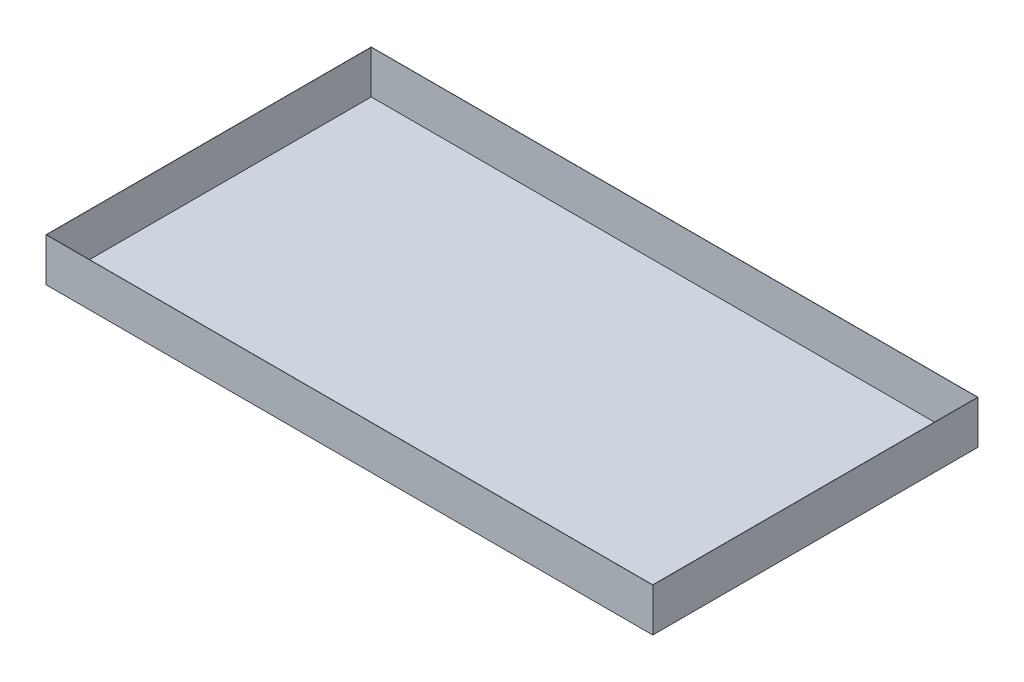
ISO-10303-21;
HEADER;
FILE_DESCRIPTION(('STEP AP214'),'2;1');
FILE_NAME('part.step','',(''),(''),'','','');
FILE_SCHEMA(('AUTOMOTIVE_DESIGN { 1 0 10303 214 1 1 1 1 }'));
ENDSEC;
DATA;
#1=APPLICATION_CONTEXT('core data for automotive mechanical design processes');
#2=APPLICATION_PROTOCOL_DEFINITION('international standard','automotive_design',2000,#1);
#3=PRODUCT_CONTEXT('',#1,'mechanical');
#4=PRODUCT('Part','Part','',(#3));
#5=PRODUCT_RELATED_PRODUCT_CATEGORY('part','',(#4));
#6=PRODUCT_DEFINITION_FORMATION('','',#4);
#7=PRODUCT_DEFINITION_CONTEXT('part definition',#1,'design');
#8=PRODUCT_DEFINITION('design','',#6,#7);
#9=PRODUCT_DEFINITION_SHAPE('','',#8);
#10=(LENGTH_UNIT() NAMED_UNIT(*) SI_UNIT(.MILLI.,.METRE.));
#11=(NAMED_UNIT(*) PLANE_ANGLE_UNIT() SI_UNIT($,.RADIAN.));
#12=(NAMED_UNIT(*) SI_UNIT($,.STERADIAN.) SOLID_ANGLE_UNIT());
#13=UNCERTAINTY_MEASURE_WITH_UNIT(LENGTH_MEASURE(1.E-05),#10,'distance_accuracy_value','');
#14=(GEOMETRIC_REPRESENTATION_CONTEXT(3) GLOBAL_UNCERTAINTY_ASSIGNED_CONTEXT((#13)) GLOBAL_UNIT_ASSIGNED_CONTEXT((#10,
#11,#12)) REPRESENTATION_CONTEXT('',''));
#15=CARTESIAN_POINT('',(0.,0.,0.));
#16=DIRECTION('',(0.,0.,1.));
#17=DIRECTION('',(1.,0.,0.));
#18=AXIS2_PLACEMENT_3D('',#15,#16,#17);
#19=CARTESIAN_POINT('',(0.,10.,0.));
#20=DIRECTION('',(0.,1.,0.));
#21=DIRECTION('',(0.,0.,1.));
#22=AXIS2_PLACEMENT_3D('',#19,#20,#21);
#23=PLANE('',#22);
#24=DIRECTION('',(0.,0.,1.));
#25=VECTOR('',#24,1.);
#26=CARTESIAN_POINT('',(-14000.,10.,7500.));
#27=LINE('',#26,#25);
#28=CARTESIAN_POINT('',(-14000.,10.,-7500.));
#29=VERTEX_POINT('',#28);
#30=CARTESIAN_POINT('',(-14000.,10.,7500.));
#31=VERTEX_POINT('',#30);
#32=EDGE_CURVE('E104',#29,#31,#27,.T.);
#33=ORIENTED_EDGE('',*,*,#32,.T.);
#34=DIRECTION('',(1.,0.,0.));
#35=VECTOR('',#34,1.);
#36=CARTESIAN_POINT('',(14000.,10.,7500.));
#37=LINE('',#36,#35);
#38=CARTESIAN_POINT('',(14000.,10.,7500.));
#39=VERTEX_POINT('',#38);
#40=EDGE_CURVE('E57',#31,#39,#37,.T.);
#41=ORIENTED_EDGE('',*,*,#40,.T.);
#42=DIRECTION('',(0.,0.,-1.));
#43=VECTOR('',#42,1.);
#44=CARTESIAN_POINT('',(14000.,10.,7500.));
#45=LINE('',#44,#43);
#46=CARTESIAN_POINT('',(14000.,10.,-7500.));
#47=VERTEX_POINT('',#46);
#48=EDGE_CURVE('E42',#39,#47,#45,.T.);
#49=ORIENTED_EDGE('',*,*,#48,.T.);
#50=DIRECTION('',(-1.,0.,0.));
#51=VECTOR('',#50,1.);
#52=CARTESIAN_POINT('',(14000.,10.,-7500.));
#53=LINE('',#52,#51);
#54=EDGE_CURVE('E11',#47,#29,#53,.T.);
#55=ORIENTED_EDGE('',*,*,#54,.T.);
#56=EDGE_LOOP('',(#33,#41,#49,#55));
#57=FACE_BOUND('',#56,.T.);
#58=ADVANCED_FACE('F34',(#57),#23,.T.);
#59=CARTESIAN_POINT('',(14010.,2000.,-7510.));
#60=DIRECTION('',(1.,0.,0.));
#61=DIRECTION('',(0.,0.,-1.));
#62=AXIS2_PLACEMENT_3D('',#59,#60,#61);
#63=PLANE('',#62);
#64=DIRECTION('',(0.,0.,1.));
#65=VECTOR('',#64,1.);
#66=CARTESIAN_POINT('',(14010.,0.,-7510.));
#67=LINE('',#66,#65);
#68=CARTESIAN_POINT('',(14010.,0.,-7510.));
#69=VERTEX_POINT('',#68);
#70=CARTESIAN_POINT('',(14010.,0.,7510.));
#71=VERTEX_POINT('',#70);
#72=EDGE_CURVE('E126',#69,#71,#67,.T.);
#73=ORIENTED_EDGE('',*,*,#72,.F.);
#74=DIRECTION('',(0.,-1.,0.));
#75=VECTOR('',#74,1.);
#76=CARTESIAN_POINT('',(14010.,2000.,-7510.));
#77=LINE('',#76,#75);
#78=CARTESIAN_POINT('',(14010.,2000.,-7510.));
#79=VERTEX_POINT('',#78);
#80=EDGE_CURVE('E154',#79,#69,#77,.T.);
#81=ORIENTED_EDGE('',*,*,#80,.F.);
#82=DIRECTION('',(0.,0.,1.));
#83=VECTOR('',#82,1.);
#84=CARTESIAN_POINT('',(14010.,2000.,-7510.));
#85=LINE('',#84,#83);
#86=CARTESIAN_POINT('',(14010.,2000.,7510.));
#87=VERTEX_POINT('',#86);
#88=EDGE_CURVE('E130',#79,#87,#85,.T.);
#89=ORIENTED_EDGE('',*,*,#88,.T.);
#90=DIRECTION('',(0.,-1.,0.));
#91=VECTOR('',#90,1.);
#92=CARTESIAN_POINT('',(14010.,2000.,7510.));
#93=LINE('',#92,#91);
#94=EDGE_CURVE('E143',#87,#71,#93,.T.);
#95=ORIENTED_EDGE('',*,*,#94,.T.);
#96=EDGE_LOOP('',(#73,#81,#89,#95));
#97=FACE_BOUND('',#96,.T.);
#98=ADVANCED_FACE('F176',(#97),#63,.T.);
#99=CARTESIAN_POINT('',(14010.,2000.,-7510.));
#100=DIRECTION('',(0.,0.,-1.));
#101=DIRECTION('',(-1.,0.,0.));
#102=AXIS2_PLACEMENT_3D('',#99,#100,#101);
#103=PLANE('',#102);
#104=DIRECTION('',(1.,0.,0.));
#105=VECTOR('',#104,1.);
#106=CARTESIAN_POINT('',(14010.,0.,-7510.));
#107=LINE('',#106,#105);
#108=CARTESIAN_POINT('',(-14010.,0.,-7510.));
#109=VERTEX_POINT('',#108);
#110=EDGE_CURVE('E134',#109,#69,#107,.T.);
#111=ORIENTED_EDGE('',*,*,#110,.F.);
#112=DIRECTION('',(0.,-1.,0.));
#113=VECTOR('',#112,1.);
#114=CARTESIAN_POINT('',(-14010.,2000.,-7510.));
#115=LINE('',#114,#113);
#116=CARTESIAN_POINT('',(-14010.,2000.,-7510.));
#117=VERTEX_POINT('',#116);
#118=EDGE_CURVE('E156',#117,#109,#115,.T.);
#119=ORIENTED_EDGE('',*,*,#118,.F.);
#120=DIRECTION('',(1.,0.,0.));
#121=VECTOR('',#120,1.);
#122=CARTESIAN_POINT('',(14010.,2000.,-7510.));
#123=LINE('',#122,#121);
#124=EDGE_CURVE('E140',#117,#79,#123,.T.);
#125=ORIENTED_EDGE('',*,*,#124,.T.);
#126=ORIENTED_EDGE('',*,*,#80,.T.);
#127=EDGE_LOOP('',(#111,#119,#125,#126));
#128=FACE_BOUND('',#127,.T.);
#129=ADVANCED_FACE('F180',(#128),#103,.T.);
#130=CARTESIAN_POINT('',(-14010.,2000.,-7510.));
#131=DIRECTION('',(-1.,0.,0.));
#132=DIRECTION('',(0.,0.,1.));
#133=AXIS2_PLACEMENT_3D('',#130,#131,#132);
#134=PLANE('',#133);
#135=DIRECTION('',(0.,0.,-1.));
#136=VECTOR('',#135,1.);
#137=CARTESIAN_POINT('',(-14010.,0.,-7510.));
#138=LINE('',#137,#136);
#139=CARTESIAN_POINT('',(-14010.,0.,7510.));
#140=VERTEX_POINT('',#139);
#141=EDGE_CURVE('E149',#140,#109,#138,.T.);
#142=ORIENTED_EDGE('',*,*,#141,.F.);
#143=DIRECTION('',(0.,-1.,0.));
#144=VECTOR('',#143,1.);
#145=CARTESIAN_POINT('',(-14010.,2000.,7510.));
#146=LINE('',#145,#144);
#147=CARTESIAN_POINT('',(-14010.,2000.,7510.));
#148=VERTEX_POINT('',#147);
#149=EDGE_CURVE('E158',#148,#140,#146,.T.);
#150=ORIENTED_EDGE('',*,*,#149,.F.);
#151=DIRECTION('',(0.,0.,-1.));
#152=VECTOR('',#151,1.);
#153=CARTESIAN_POINT('',(-14010.,2000.,-7510.));
#154=LINE('',#153,#152);
#155=EDGE_CURVE('E137',#148,#117,#154,.T.);
#156=ORIENTED_EDGE('',*,*,#155,.T.);
#157=ORIENTED_EDGE('',*,*,#118,.T.);
#158=EDGE_LOOP('',(#142,#150,#156,#157));
#159=FACE_BOUND('',#158,.T.);
#160=ADVANCED_FACE('F187',(#159),#134,.T.);
#161=CARTESIAN_POINT('',(14010.,2000.,7510.));
#162=DIRECTION('',(0.,0.,1.));
#163=DIRECTION('',(1.,0.,0.));
#164=AXIS2_PLACEMENT_3D('',#161,#162,#163);
#165=PLANE('',#164);
#166=DIRECTION('',(-1.,0.,0.));
#167=VECTOR('',#166,1.);
#168=CARTESIAN_POINT('',(14010.,0.,7510.));
#169=LINE('',#168,#167);
#170=EDGE_CURVE('E146',#71,#140,#169,.T.);
#171=ORIENTED_EDGE('',*,*,#170,.F.);
#172=ORIENTED_EDGE('',*,*,#94,.F.);
#173=DIRECTION('',(-1.,0.,0.));
#174=VECTOR('',#173,1.);
#175=CARTESIAN_POINT('',(14010.,2000.,7510.));
#176=LINE('',#175,#174);
#177=EDGE_CURVE('E133',#87,#148,#176,.T.);
#178=ORIENTED_EDGE('',*,*,#177,.T.);
#179=ORIENTED_EDGE('',*,*,#149,.T.);
#180=EDGE_LOOP('',(#171,#172,#178,#179));
#181=FACE_BOUND('',#180,.T.);
#182=ADVANCED_FACE('F184',(#181),#165,.T.);
#183=CARTESIAN_POINT('',(0.,2000.,0.));
#184=DIRECTION('',(0.,-1.,0.));
#185=DIRECTION('',(0.,0.,-1.));
#186=AXIS2_PLACEMENT_3D('',#183,#184,#185);
#187=PLANE('',#186);
#188=DIRECTION('',(-1.,0.,0.));
#189=VECTOR('',#188,1.);
#190=CARTESIAN_POINT('',(14000.,2000.,7500.));
#191=LINE('',#190,#189);
#192=CARTESIAN_POINT('',(14000.,2000.,7500.));
#193=VERTEX_POINT('',#192);
#194=CARTESIAN_POINT('',(-14000.,2000.,7500.));
#195=VERTEX_POINT('',#194);
#196=EDGE_CURVE('E106',#193,#195,#191,.T.);
#197=ORIENTED_EDGE('',*,*,#196,.T.);
#198=DIRECTION('',(0.,0.,-1.));
#199=VECTOR('',#198,1.);
#200=CARTESIAN_POINT('',(-14000.,2000.,-7500.));
#201=LINE('',#200,#199);
#202=CARTESIAN_POINT('',(-14000.,2000.,-7500.));
#203=VERTEX_POINT('',#202);
#204=EDGE_CURVE('E101',#195,#203,#201,.T.);
#205=ORIENTED_EDGE('',*,*,#204,.T.);
#206=DIRECTION('',(1.,0.,0.));
#207=VECTOR('',#206,1.);
#208=CARTESIAN_POINT('',(14000.,2000.,-7500.));
#209=LINE('',#208,#207);
#210=CARTESIAN_POINT('',(14000.,2000.,-7500.));
#211=VERTEX_POINT('',#210);
#212=EDGE_CURVE('E110',#203,#211,#209,.T.);
#213=ORIENTED_EDGE('',*,*,#212,.T.);
#214=DIRECTION('',(0.,0.,1.));
#215=VECTOR('',#214,1.);
#216=CARTESIAN_POINT('',(14000.,2000.,-7500.));
#217=LINE('',#216,#215);
#218=EDGE_CURVE('E115',#211,#193,#217,.T.);
#219=ORIENTED_EDGE('',*,*,#218,.T.);
#220=EDGE_LOOP('',(#197,#205,#213,#219));
#221=FACE_BOUND('',#220,.T.);
#222=ORIENTED_EDGE('',*,*,#88,.F.);
#223=ORIENTED_EDGE('',*,*,#124,.F.);
#224=ORIENTED_EDGE('',*,*,#155,.F.);
#225=ORIENTED_EDGE('',*,*,#177,.F.);
#226=EDGE_LOOP('',(#222,#223,#224,#225));
#227=FACE_BOUND('',#226,.T.);
#228=ADVANCED_FACE('F117',(#221,#227),#187,.F.);
#229=CARTESIAN_POINT('',(-14000.,2000.,-7500.));
#230=DIRECTION('',(-1.,0.,0.));
#231=DIRECTION('',(0.,0.,1.));
#232=AXIS2_PLACEMENT_3D('',#229,#230,#231);
#233=PLANE('',#232);
#234=ORIENTED_EDGE('',*,*,#32,.F.);
#235=DIRECTION('',(0.,-1.,0.));
#236=VECTOR('',#235,1.);
#237=CARTESIAN_POINT('',(-14000.,2000.,-7500.));
#238=LINE('',#237,#236);
#239=EDGE_CURVE('E49',#203,#29,#238,.T.);
#240=ORIENTED_EDGE('',*,*,#239,.F.);
#241=ORIENTED_EDGE('',*,*,#204,.F.);
#242=DIRECTION('',(0.,-1.,0.));
#243=VECTOR('',#242,1.);
#244=CARTESIAN_POINT('',(-14000.,2000.,7500.));
#245=LINE('',#244,#243);
#246=EDGE_CURVE('E124',#195,#31,#245,.T.);
#247=ORIENTED_EDGE('',*,*,#246,.T.);
#248=EDGE_LOOP('',(#234,#240,#241,#247));
#249=FACE_BOUND('',#248,.T.);
#250=ADVANCED_FACE('F99',(#249),#233,.F.);
#251=CARTESIAN_POINT('',(14000.,2000.,7500.));
#252=DIRECTION('',(0.,0.,1.));
#253=DIRECTION('',(1.,0.,0.));
#254=AXIS2_PLACEMENT_3D('',#251,#252,#253);
#255=PLANE('',#254);
#256=ORIENTED_EDGE('',*,*,#40,.F.);
#257=ORIENTED_EDGE('',*,*,#246,.F.);
#258=ORIENTED_EDGE('',*,*,#196,.F.);
#259=DIRECTION('',(0.,-1.,0.));
#260=VECTOR('',#259,1.);
#261=CARTESIAN_POINT('',(14000.,2000.,7500.));
#262=LINE('',#261,#260);
#263=EDGE_CURVE('E127',#193,#39,#262,.T.);
#264=ORIENTED_EDGE('',*,*,#263,.T.);
#265=EDGE_LOOP('',(#256,#257,#258,#264));
#266=FACE_BOUND('',#265,.T.);
#267=ADVANCED_FACE('F166',(#266),#255,.F.);
#268=CARTESIAN_POINT('',(14000.,2000.,-7500.));
#269=DIRECTION('',(1.,0.,0.));
#270=DIRECTION('',(0.,0.,-1.));
#271=AXIS2_PLACEMENT_3D('',#268,#269,#270);
#272=PLANE('',#271);
#273=ORIENTED_EDGE('',*,*,#48,.F.);
#274=ORIENTED_EDGE('',*,*,#263,.F.);
#275=ORIENTED_EDGE('',*,*,#218,.F.);
#276=DIRECTION('',(0.,-1.,0.));
#277=VECTOR('',#276,1.);
#278=CARTESIAN_POINT('',(14000.,2000.,-7500.));
#279=LINE('',#278,#277);
#280=EDGE_CURVE('E105',#211,#47,#279,.T.);
#281=ORIENTED_EDGE('',*,*,#280,.T.);
#282=EDGE_LOOP('',(#273,#274,#275,#281));
#283=FACE_BOUND('',#282,.T.);
#284=ADVANCED_FACE('F165',(#283),#272,.F.);
#285=CARTESIAN_POINT('',(14000.,2000.,-7500.));
#286=DIRECTION('',(0.,0.,-1.));
#287=DIRECTION('',(-1.,0.,0.));
#288=AXIS2_PLACEMENT_3D('',#285,#286,#287);
#289=PLANE('',#288);
#290=ORIENTED_EDGE('',*,*,#54,.F.);
#291=ORIENTED_EDGE('',*,*,#280,.F.);
#292=ORIENTED_EDGE('',*,*,#212,.F.);
#293=ORIENTED_EDGE('',*,*,#239,.T.);
#294=EDGE_LOOP('',(#290,#291,#292,#293));
#295=FACE_BOUND('',#294,.T.);
#296=ADVANCED_FACE('F111',(#295),#289,.F.);
#297=CARTESIAN_POINT('',(0.,0.,0.));
#298=DIRECTION('',(0.,1.,0.));
#299=DIRECTION('',(0.,0.,1.));
#300=AXIS2_PLACEMENT_3D('',#297,#298,#299);
#301=PLANE('',#300);
#302=ORIENTED_EDGE('',*,*,#72,.T.);
#303=ORIENTED_EDGE('',*,*,#170,.T.);
#304=ORIENTED_EDGE('',*,*,#141,.T.);
#305=ORIENTED_EDGE('',*,*,#110,.T.);
#306=EDGE_LOOP('',(#302,#303,#304,#305));
#307=FACE_BOUND('',#306,.T.);
#308=ADVANCED_FACE('F36',(#307),#301,.F.);
#309=CLOSED_SHELL('',(#58,#98,#129,#160,#182,#228,#250,#267,#284,#296,#308));
#310=MANIFOLD_SOLID_BREP('B2',#309);
#311=ADVANCED_BREP_SHAPE_REPRESENTATION('',(#18,#310),#14);
#312=SHAPE_DEFINITION_REPRESENTATION(#9,#311);
ENDSEC;
END-ISO-10303-21;
